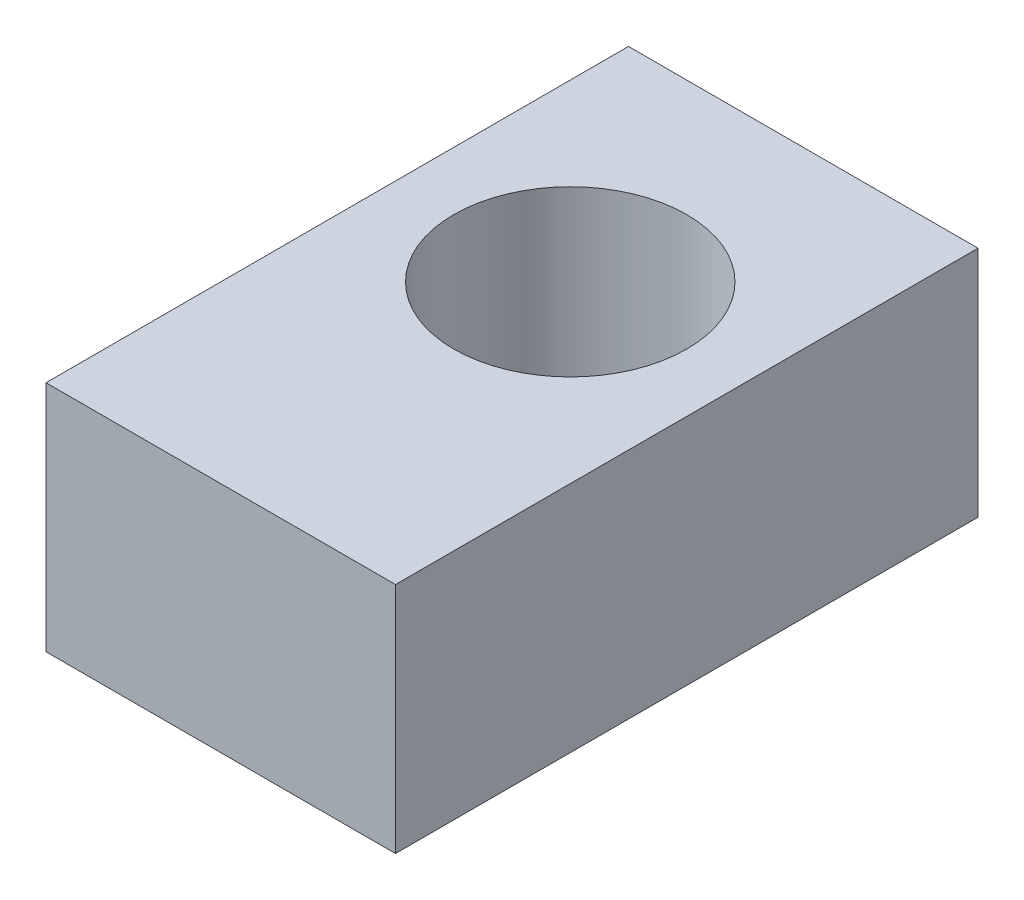
ISO-10303-21;
HEADER;
FILE_DESCRIPTION(('STEP AP214'),'2;1');
FILE_NAME('part.step','',(''),(''),'','','');
FILE_SCHEMA(('AUTOMOTIVE_DESIGN { 1 0 10303 214 1 1 1 1 }'));
ENDSEC;
DATA;
#1=APPLICATION_CONTEXT('core data for automotive mechanical design processes');
#2=APPLICATION_PROTOCOL_DEFINITION('international standard','automotive_design',2000,#1);
#3=PRODUCT_CONTEXT('',#1,'mechanical');
#4=PRODUCT('Part','Part','',(#3));
#5=PRODUCT_RELATED_PRODUCT_CATEGORY('part','',(#4));
#6=PRODUCT_DEFINITION_FORMATION('','',#4);
#7=PRODUCT_DEFINITION_CONTEXT('part definition',#1,'design');
#8=PRODUCT_DEFINITION('design','',#6,#7);
#9=PRODUCT_DEFINITION_SHAPE('','',#8);
#10=(LENGTH_UNIT() NAMED_UNIT(*) SI_UNIT(.MILLI.,.METRE.));
#11=(NAMED_UNIT(*) PLANE_ANGLE_UNIT() SI_UNIT($,.RADIAN.));
#12=(NAMED_UNIT(*) SI_UNIT($,.STERADIAN.) SOLID_ANGLE_UNIT());
#13=UNCERTAINTY_MEASURE_WITH_UNIT(LENGTH_MEASURE(1.E-05),#10,'distance_accuracy_value','');
#14=(GEOMETRIC_REPRESENTATION_CONTEXT(3) GLOBAL_UNCERTAINTY_ASSIGNED_CONTEXT((#13)) GLOBAL_UNIT_ASSIGNED_CONTEXT((#10,
#11,#12)) REPRESENTATION_CONTEXT('',''));
#15=CARTESIAN_POINT('',(0.,0.,0.));
#16=DIRECTION('',(0.,0.,1.));
#17=DIRECTION('',(1.,0.,0.));
#18=AXIS2_PLACEMENT_3D('',#15,#16,#17);
#19=CARTESIAN_POINT('',(0.,10.,0.));
#20=DIRECTION('',(0.,-1.,0.));
#21=DIRECTION('',(0.,0.,-1.));
#22=AXIS2_PLACEMENT_3D('',#19,#20,#21);
#23=PLANE('',#22);
#24=DIRECTION('',(1.,0.,0.));
#25=VECTOR('',#24,1.);
#26=CARTESIAN_POINT('',(30.,10.,0.));
#27=LINE('',#26,#25);
#28=CARTESIAN_POINT('',(0.,10.,0.));
#29=VERTEX_POINT('',#28);
#30=CARTESIAN_POINT('',(30.,10.,0.));
#31=VERTEX_POINT('',#30);
#32=EDGE_CURVE('E95',#29,#31,#27,.T.);
#33=ORIENTED_EDGE('',*,*,#32,.T.);
#34=DIRECTION('',(0.,0.,-1.));
#35=VECTOR('',#34,1.);
#36=CARTESIAN_POINT('',(30.,10.,-50.));
#37=LINE('',#36,#35);
#38=CARTESIAN_POINT('',(30.,10.,-50.));
#39=VERTEX_POINT('',#38);
#40=EDGE_CURVE('E90',#31,#39,#37,.T.);
#41=ORIENTED_EDGE('',*,*,#40,.T.);
#42=DIRECTION('',(-1.,0.,0.));
#43=VECTOR('',#42,1.);
#44=CARTESIAN_POINT('',(0.,10.,-50.));
#45=LINE('',#44,#43);
#46=CARTESIAN_POINT('',(0.,10.,-50.));
#47=VERTEX_POINT('',#46);
#48=EDGE_CURVE('E93',#39,#47,#45,.T.);
#49=ORIENTED_EDGE('',*,*,#48,.T.);
#50=DIRECTION('',(0.,0.,1.));
#51=VECTOR('',#50,1.);
#52=CARTESIAN_POINT('',(0.,10.,0.));
#53=LINE('',#52,#51);
#54=EDGE_CURVE('E60',#47,#29,#53,.T.);
#55=ORIENTED_EDGE('',*,*,#54,.T.);
#56=EDGE_LOOP('',(#33,#41,#49,#55));
#57=FACE_BOUND('',#56,.T.);
#58=CARTESIAN_POINT('',(15.,10.,-30.));
#59=DIRECTION('',(0.,1.,0.));
#60=DIRECTION('',(0.,0.,1.));
#61=AXIS2_PLACEMENT_3D('',#58,#59,#60);
#62=CIRCLE('',#61,10.);
#63=CARTESIAN_POINT('',(15.,10.,-20.));
#64=VERTEX_POINT('',#63);
#65=EDGE_CURVE('E110',#64,#64,#62,.T.);
#66=ORIENTED_EDGE('',*,*,#65,.F.);
#67=EDGE_LOOP('',(#66));
#68=FACE_BOUND('',#67,.T.);
#69=ADVANCED_FACE('F43',(#57,#68),#23,.F.);
#70=CARTESIAN_POINT('',(0.,-10.,0.));
#71=DIRECTION('',(0.,-1.,0.));
#72=DIRECTION('',(0.,0.,-1.));
#73=AXIS2_PLACEMENT_3D('',#70,#71,#72);
#74=PLANE('',#73);
#75=DIRECTION('',(1.,0.,0.));
#76=VECTOR('',#75,1.);
#77=CARTESIAN_POINT('',(30.,-10.,0.));
#78=LINE('',#77,#76);
#79=CARTESIAN_POINT('',(0.,-10.,0.));
#80=VERTEX_POINT('',#79);
#81=CARTESIAN_POINT('',(30.,-10.,0.));
#82=VERTEX_POINT('',#81);
#83=EDGE_CURVE('E107',#80,#82,#78,.T.);
#84=ORIENTED_EDGE('',*,*,#83,.F.);
#85=DIRECTION('',(0.,0.,1.));
#86=VECTOR('',#85,1.);
#87=CARTESIAN_POINT('',(0.,-10.,0.));
#88=LINE('',#87,#86);
#89=CARTESIAN_POINT('',(0.,-10.,-50.));
#90=VERTEX_POINT('',#89);
#91=EDGE_CURVE('E83',#90,#80,#88,.T.);
#92=ORIENTED_EDGE('',*,*,#91,.F.);
#93=DIRECTION('',(-1.,0.,0.));
#94=VECTOR('',#93,1.);
#95=CARTESIAN_POINT('',(0.,-10.,-50.));
#96=LINE('',#95,#94);
#97=CARTESIAN_POINT('',(30.,-10.,-50.));
#98=VERTEX_POINT('',#97);
#99=EDGE_CURVE('E77',#98,#90,#96,.T.);
#100=ORIENTED_EDGE('',*,*,#99,.F.);
#101=DIRECTION('',(0.,0.,-1.));
#102=VECTOR('',#101,1.);
#103=CARTESIAN_POINT('',(30.,-10.,-50.));
#104=LINE('',#103,#102);
#105=EDGE_CURVE('E99',#82,#98,#104,.T.);
#106=ORIENTED_EDGE('',*,*,#105,.F.);
#107=EDGE_LOOP('',(#84,#92,#100,#106));
#108=FACE_BOUND('',#107,.T.);
#109=CARTESIAN_POINT('',(15.,-10.,-30.));
#110=DIRECTION('',(0.,1.,0.));
#111=DIRECTION('',(0.,0.,1.));
#112=AXIS2_PLACEMENT_3D('',#109,#110,#111);
#113=CIRCLE('',#112,10.);
#114=CARTESIAN_POINT('',(15.,-10.,-20.));
#115=VERTEX_POINT('',#114);
#116=EDGE_CURVE('E122',#115,#115,#113,.T.);
#117=ORIENTED_EDGE('',*,*,#116,.T.);
#118=EDGE_LOOP('',(#117));
#119=FACE_BOUND('',#118,.T.);
#120=ADVANCED_FACE('F118',(#108,#119),#74,.T.);
#121=CARTESIAN_POINT('',(30.,10.,0.));
#122=DIRECTION('',(0.,0.,-1.));
#123=DIRECTION('',(-1.,0.,0.));
#124=AXIS2_PLACEMENT_3D('',#121,#122,#123);
#125=PLANE('',#124);
#126=ORIENTED_EDGE('',*,*,#83,.T.);
#127=DIRECTION('',(0.,-1.,0.));
#128=VECTOR('',#127,1.);
#129=CARTESIAN_POINT('',(30.,10.,0.));
#130=LINE('',#129,#128);
#131=EDGE_CURVE('E11',#31,#82,#130,.T.);
#132=ORIENTED_EDGE('',*,*,#131,.F.);
#133=ORIENTED_EDGE('',*,*,#32,.F.);
#134=DIRECTION('',(0.,-1.,0.));
#135=VECTOR('',#134,1.);
#136=CARTESIAN_POINT('',(0.,10.,0.));
#137=LINE('',#136,#135);
#138=EDGE_CURVE('E103',#29,#80,#137,.T.);
#139=ORIENTED_EDGE('',*,*,#138,.T.);
#140=EDGE_LOOP('',(#126,#132,#133,#139));
#141=FACE_BOUND('',#140,.T.);
#142=ADVANCED_FACE('F45',(#141),#125,.F.);
#143=CARTESIAN_POINT('',(30.,10.,-50.));
#144=DIRECTION('',(-1.,0.,0.));
#145=DIRECTION('',(0.,0.,1.));
#146=AXIS2_PLACEMENT_3D('',#143,#144,#145);
#147=PLANE('',#146);
#148=ORIENTED_EDGE('',*,*,#105,.T.);
#149=DIRECTION('',(0.,-1.,0.));
#150=VECTOR('',#149,1.);
#151=CARTESIAN_POINT('',(30.,10.,-50.));
#152=LINE('',#151,#150);
#153=EDGE_CURVE('E52',#39,#98,#152,.T.);
#154=ORIENTED_EDGE('',*,*,#153,.F.);
#155=ORIENTED_EDGE('',*,*,#40,.F.);
#156=ORIENTED_EDGE('',*,*,#131,.T.);
#157=EDGE_LOOP('',(#148,#154,#155,#156));
#158=FACE_BOUND('',#157,.T.);
#159=ADVANCED_FACE('F98',(#158),#147,.F.);
#160=CARTESIAN_POINT('',(0.,10.,-50.));
#161=DIRECTION('',(0.,0.,1.));
#162=DIRECTION('',(1.,0.,0.));
#163=AXIS2_PLACEMENT_3D('',#160,#161,#162);
#164=PLANE('',#163);
#165=ORIENTED_EDGE('',*,*,#99,.T.);
#166=DIRECTION('',(0.,-1.,0.));
#167=VECTOR('',#166,1.);
#168=CARTESIAN_POINT('',(0.,10.,-50.));
#169=LINE('',#168,#167);
#170=EDGE_CURVE('E100',#47,#90,#169,.T.);
#171=ORIENTED_EDGE('',*,*,#170,.F.);
#172=ORIENTED_EDGE('',*,*,#48,.F.);
#173=ORIENTED_EDGE('',*,*,#153,.T.);
#174=EDGE_LOOP('',(#165,#171,#172,#173));
#175=FACE_BOUND('',#174,.T.);
#176=ADVANCED_FACE('F101',(#175),#164,.F.);
#177=CARTESIAN_POINT('',(0.,10.,0.));
#178=DIRECTION('',(1.,0.,0.));
#179=DIRECTION('',(0.,0.,-1.));
#180=AXIS2_PLACEMENT_3D('',#177,#178,#179);
#181=PLANE('',#180);
#182=ORIENTED_EDGE('',*,*,#91,.T.);
#183=ORIENTED_EDGE('',*,*,#138,.F.);
#184=ORIENTED_EDGE('',*,*,#54,.F.);
#185=ORIENTED_EDGE('',*,*,#170,.T.);
#186=EDGE_LOOP('',(#182,#183,#184,#185));
#187=FACE_BOUND('',#186,.T.);
#188=ADVANCED_FACE('F115',(#187),#181,.F.);
#189=CARTESIAN_POINT('',(15.,10.,-30.));
#190=DIRECTION('',(0.,-1.,0.));
#191=DIRECTION('',(0.,0.,-1.));
#192=AXIS2_PLACEMENT_3D('',#189,#190,#191);
#193=CYLINDRICAL_SURFACE('',#192,10.);
#194=ORIENTED_EDGE('',*,*,#65,.T.);
#195=EDGE_LOOP('',(#194));
#196=FACE_BOUND('',#195,.T.);
#197=ORIENTED_EDGE('',*,*,#116,.F.);
#198=EDGE_LOOP('',(#197));
#199=FACE_BOUND('',#198,.T.);
#200=ADVANCED_FACE('F128',(#196,#199),#193,.F.);
#201=CLOSED_SHELL('',(#69,#120,#142,#159,#176,#188,#200));
#202=MANIFOLD_SOLID_BREP('B2',#201);
#203=ADVANCED_BREP_SHAPE_REPRESENTATION('',(#18,#202),#14);
#204=SHAPE_DEFINITION_REPRESENTATION(#9,#203);
ENDSEC;
END-ISO-10303-21;
